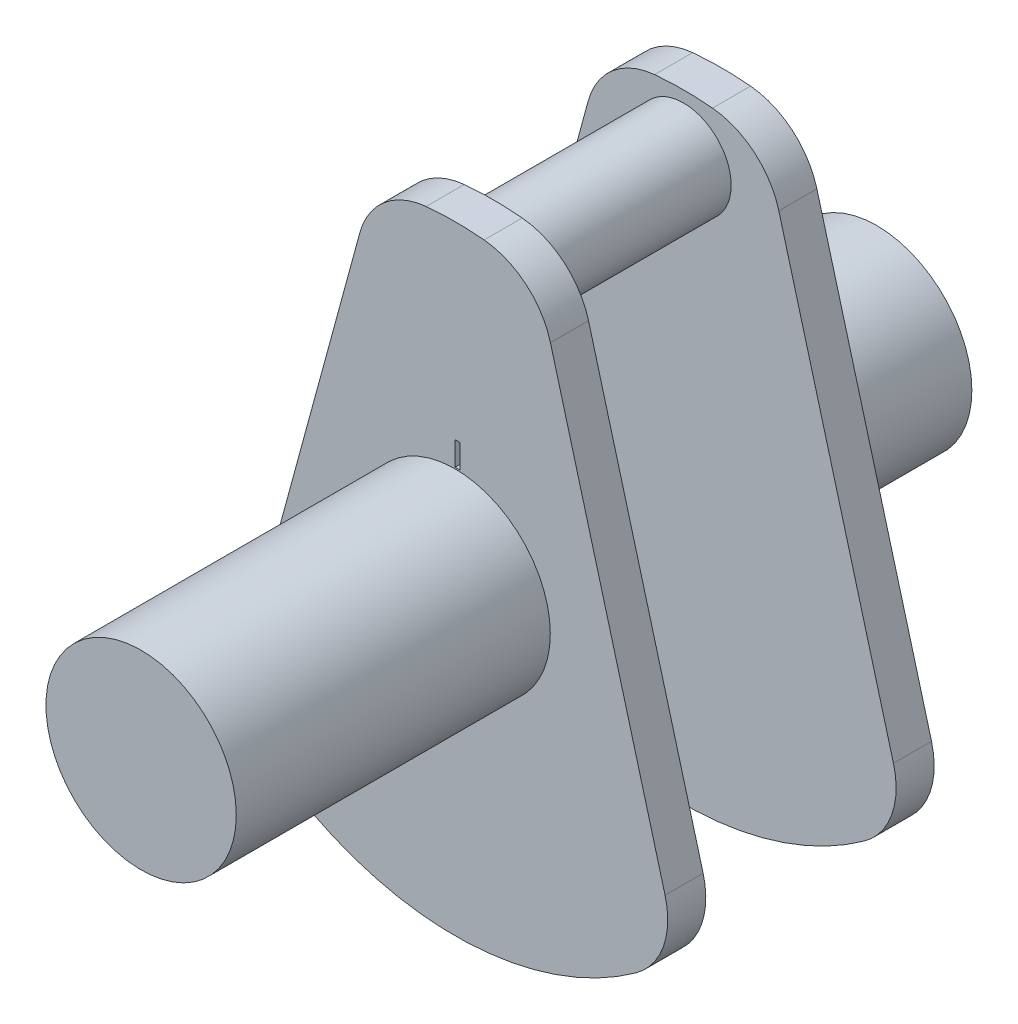
ISO-10303-21;
HEADER;
FILE_DESCRIPTION(('STEP AP214'),'2;1');
FILE_NAME('part.step','',(''),(''),'','','');
FILE_SCHEMA(('AUTOMOTIVE_DESIGN { 1 0 10303 214 1 1 1 1 }'));
ENDSEC;
DATA;
#1=APPLICATION_CONTEXT('core data for automotive mechanical design processes');
#2=APPLICATION_PROTOCOL_DEFINITION('international standard','automotive_design',2000,#1);
#3=PRODUCT_CONTEXT('',#1,'mechanical');
#4=PRODUCT('Part','Part','',(#3));
#5=PRODUCT_RELATED_PRODUCT_CATEGORY('part','',(#4));
#6=PRODUCT_DEFINITION_FORMATION('','',#4);
#7=PRODUCT_DEFINITION_CONTEXT('part definition',#1,'design');
#8=PRODUCT_DEFINITION('design','',#6,#7);
#9=PRODUCT_DEFINITION_SHAPE('','',#8);
#10=(LENGTH_UNIT() NAMED_UNIT(*) SI_UNIT(.MILLI.,.METRE.));
#11=(NAMED_UNIT(*) PLANE_ANGLE_UNIT() SI_UNIT($,.RADIAN.));
#12=(NAMED_UNIT(*) SI_UNIT($,.STERADIAN.) SOLID_ANGLE_UNIT());
#13=UNCERTAINTY_MEASURE_WITH_UNIT(LENGTH_MEASURE(1.E-05),#10,'distance_accuracy_value','');
#14=(GEOMETRIC_REPRESENTATION_CONTEXT(3) GLOBAL_UNCERTAINTY_ASSIGNED_CONTEXT((#13)) GLOBAL_UNIT_ASSIGNED_CONTEXT((#10,
#11,#12)) REPRESENTATION_CONTEXT('',''));
#15=CARTESIAN_POINT('',(0.,0.,0.));
#16=DIRECTION('',(0.,0.,1.));
#17=DIRECTION('',(1.,0.,0.));
#18=AXIS2_PLACEMENT_3D('',#15,#16,#17);
#19=CARTESIAN_POINT('',(0.459,4.87845457086565,0.8));
#20=DIRECTION('',(0.,0.,-1.));
#21=DIRECTION('',(-1.,0.,0.));
#22=AXIS2_PLACEMENT_3D('',#19,#20,#21);
#23=CYLINDRICAL_SURFACE('',#22,1.6);
#24=CARTESIAN_POINT('',(0.459,4.87845457086565,0.));
#25=DIRECTION('',(0.,0.,1.));
#26=DIRECTION('',(1.,0.,0.));
#27=AXIS2_PLACEMENT_3D('',#24,#25,#26);
#28=CIRCLE('',#27,1.6);
#29=CARTESIAN_POINT('',(2.00284320160388,5.29863092534255,0.));
#30=VERTEX_POINT('',#29);
#31=CARTESIAN_POINT('',(0.608877551020407,6.47141932869934,0.));
#32=VERTEX_POINT('',#31);
#33=EDGE_CURVE('E142',#30,#32,#28,.T.);
#34=ORIENTED_EDGE('',*,*,#33,.T.);
#35=DIRECTION('',(0.,0.,-1.));
#36=VECTOR('',#35,1.);
#37=CARTESIAN_POINT('',(0.608877551020407,6.47141932869934,0.8));
#38=LINE('',#37,#36);
#39=CARTESIAN_POINT('',(0.608877551020407,6.47141932869934,0.8));
#40=VERTEX_POINT('',#39);
#41=EDGE_CURVE('E40',#40,#32,#38,.T.);
#42=ORIENTED_EDGE('',*,*,#41,.F.);
#43=CARTESIAN_POINT('',(0.459,4.87845457086565,0.8));
#44=DIRECTION('',(0.,0.,1.));
#45=DIRECTION('',(1.,0.,0.));
#46=AXIS2_PLACEMENT_3D('',#43,#44,#45);
#47=CIRCLE('',#46,1.6);
#48=CARTESIAN_POINT('',(2.00284320160388,5.29863092534255,0.8));
#49=VERTEX_POINT('',#48);
#50=EDGE_CURVE('E158',#49,#40,#47,.T.);
#51=ORIENTED_EDGE('',*,*,#50,.F.);
#52=DIRECTION('',(0.,0.,-1.));
#53=VECTOR('',#52,1.);
#54=CARTESIAN_POINT('',(2.00284320160388,5.29863092534255,0.8));
#55=LINE('',#54,#53);
#56=EDGE_CURVE('E138',#49,#30,#55,.T.);
#57=ORIENTED_EDGE('',*,*,#56,.T.);
#58=EDGE_LOOP('',(#34,#42,#51,#57));
#59=FACE_BOUND('',#58,.T.);
#60=ADVANCED_FACE('F33',(#59),#23,.T.);
#61=CARTESIAN_POINT('',(0.,0.,0.8));
#62=DIRECTION('',(0.,0.,-1.));
#63=DIRECTION('',(-1.,0.,0.));
#64=AXIS2_PLACEMENT_3D('',#61,#62,#63);
#65=CYLINDRICAL_SURFACE('',#64,6.5);
#66=CARTESIAN_POINT('',(0.,0.,0.));
#67=DIRECTION('',(0.,0.,1.));
#68=DIRECTION('',(1.,0.,0.));
#69=AXIS2_PLACEMENT_3D('',#66,#67,#68);
#70=CIRCLE('',#69,6.5);
#71=CARTESIAN_POINT('',(-0.608877551020407,6.47141932869934,0.));
#72=VERTEX_POINT('',#71);
#73=EDGE_CURVE('E145',#32,#72,#70,.T.);
#74=ORIENTED_EDGE('',*,*,#73,.T.);
#75=DIRECTION('',(0.,0.,-1.));
#76=VECTOR('',#75,1.);
#77=CARTESIAN_POINT('',(-0.608877551020407,6.47141932869934,0.8));
#78=LINE('',#77,#76);
#79=CARTESIAN_POINT('',(-0.608877551020407,6.47141932869934,0.8));
#80=VERTEX_POINT('',#79);
#81=EDGE_CURVE('E168',#80,#72,#78,.T.);
#82=ORIENTED_EDGE('',*,*,#81,.F.);
#83=CARTESIAN_POINT('',(0.,0.,0.8));
#84=DIRECTION('',(0.,0.,1.));
#85=DIRECTION('',(1.,0.,0.));
#86=AXIS2_PLACEMENT_3D('',#83,#84,#85);
#87=CIRCLE('',#86,6.5);
#88=EDGE_CURVE('E98',#40,#80,#87,.T.);
#89=ORIENTED_EDGE('',*,*,#88,.F.);
#90=ORIENTED_EDGE('',*,*,#41,.T.);
#91=EDGE_LOOP('',(#74,#82,#89,#90));
#92=FACE_BOUND('',#91,.T.);
#93=ADVANCED_FACE('F171',(#92),#65,.T.);
#94=CARTESIAN_POINT('',(-0.459,4.87845457086565,0.8));
#95=DIRECTION('',(0.,0.,-1.));
#96=DIRECTION('',(-1.,0.,0.));
#97=AXIS2_PLACEMENT_3D('',#94,#95,#96);
#98=CYLINDRICAL_SURFACE('',#97,1.6);
#99=CARTESIAN_POINT('',(-0.459,4.87845457086565,0.));
#100=DIRECTION('',(0.,0.,1.));
#101=DIRECTION('',(-1.,0.,0.));
#102=AXIS2_PLACEMENT_3D('',#99,#100,#101);
#103=CIRCLE('',#102,1.6);
#104=CARTESIAN_POINT('',(-2.00284320160388,5.29863092534255,0.));
#105=VERTEX_POINT('',#104);
#106=EDGE_CURVE('E148',#72,#105,#103,.T.);
#107=ORIENTED_EDGE('',*,*,#106,.T.);
#108=DIRECTION('',(0.,0.,-1.));
#109=VECTOR('',#108,1.);
#110=CARTESIAN_POINT('',(-2.00284320160388,5.29863092534255,0.8));
#111=LINE('',#110,#109);
#112=CARTESIAN_POINT('',(-2.00284320160388,5.29863092534255,0.8));
#113=VERTEX_POINT('',#112);
#114=EDGE_CURVE('E165',#113,#105,#111,.T.);
#115=ORIENTED_EDGE('',*,*,#114,.F.);
#116=CARTESIAN_POINT('',(-0.459,4.87845457086565,0.8));
#117=DIRECTION('',(0.,0.,1.));
#118=DIRECTION('',(-1.,0.,0.));
#119=AXIS2_PLACEMENT_3D('',#116,#117,#118);
#120=CIRCLE('',#119,1.6);
#121=EDGE_CURVE('E189',#80,#113,#120,.T.);
#122=ORIENTED_EDGE('',*,*,#121,.F.);
#123=ORIENTED_EDGE('',*,*,#81,.T.);
#124=EDGE_LOOP('',(#107,#115,#122,#123));
#125=FACE_BOUND('',#124,.T.);
#126=ADVANCED_FACE('F182',(#125),#98,.T.);
#127=CARTESIAN_POINT('',(-2.00284320160388,5.29863092534255,0.8));
#128=DIRECTION('',(0.964902001002423,-0.26261022154806,0.));
#129=DIRECTION('',(0.26261022154806,0.964902001002423,0.));
#130=AXIS2_PLACEMENT_3D('',#127,#128,#129);
#131=PLANE('',#130);
#132=DIRECTION('',(-0.26261022154806,-0.964902001002422,0.));
#133=VECTOR('',#132,1.);
#134=CARTESIAN_POINT('',(-2.00284320160388,5.29863092534255,0.));
#135=LINE('',#134,#133);
#136=CARTESIAN_POINT('',(-4.41186786120333,-3.55278658921254,0.));
#137=VERTEX_POINT('',#136);
#138=EDGE_CURVE('E150',#105,#137,#135,.T.);
#139=ORIENTED_EDGE('',*,*,#138,.T.);
#140=DIRECTION('',(0.,0.,-1.));
#141=VECTOR('',#140,1.);
#142=CARTESIAN_POINT('',(-4.41186786120333,-3.55278658921254,0.8));
#143=LINE('',#142,#141);
#144=CARTESIAN_POINT('',(-4.41186786120333,-3.55278658921254,0.8));
#145=VERTEX_POINT('',#144);
#146=EDGE_CURVE('E162',#145,#137,#143,.T.);
#147=ORIENTED_EDGE('',*,*,#146,.F.);
#148=DIRECTION('',(-0.26261022154806,-0.964902001002422,0.));
#149=VECTOR('',#148,1.);
#150=CARTESIAN_POINT('',(-2.00284320160388,5.29863092534255,0.8));
#151=LINE('',#150,#149);
#152=EDGE_CURVE('E188',#113,#145,#151,.T.);
#153=ORIENTED_EDGE('',*,*,#152,.F.);
#154=ORIENTED_EDGE('',*,*,#114,.T.);
#155=EDGE_LOOP('',(#139,#147,#153,#154));
#156=FACE_BOUND('',#155,.T.);
#157=ADVANCED_FACE('F186',(#156),#131,.F.);
#158=CARTESIAN_POINT('',(-2.86802465959945,-3.97296294368944,0.8));
#159=DIRECTION('',(0.,0.,-1.));
#160=DIRECTION('',(-1.,0.,0.));
#161=AXIS2_PLACEMENT_3D('',#158,#159,#160);
#162=CYLINDRICAL_SURFACE('',#161,1.6);
#163=CARTESIAN_POINT('',(-2.86802465959945,-3.97296294368944,0.));
#164=DIRECTION('',(0.,0.,1.));
#165=DIRECTION('',(1.,0.,0.));
#166=AXIS2_PLACEMENT_3D('',#163,#164,#165);
#167=CIRCLE('',#166,1.6);
#168=CARTESIAN_POINT('',(-3.80452250763192,-5.27025696611864,0.));
#169=VERTEX_POINT('',#168);
#170=EDGE_CURVE('E152',#137,#169,#167,.T.);
#171=ORIENTED_EDGE('',*,*,#170,.T.);
#172=DIRECTION('',(0.,0.,-1.));
#173=VECTOR('',#172,1.);
#174=CARTESIAN_POINT('',(-3.80452250763192,-5.27025696611864,0.8));
#175=LINE('',#174,#173);
#176=CARTESIAN_POINT('',(-3.80452250763192,-5.27025696611864,0.8));
#177=VERTEX_POINT('',#176);
#178=EDGE_CURVE('E133',#177,#169,#175,.T.);
#179=ORIENTED_EDGE('',*,*,#178,.F.);
#180=CARTESIAN_POINT('',(-2.86802465959945,-3.97296294368944,0.8));
#181=DIRECTION('',(0.,0.,1.));
#182=DIRECTION('',(1.,0.,0.));
#183=AXIS2_PLACEMENT_3D('',#180,#181,#182);
#184=CIRCLE('',#183,1.6);
#185=EDGE_CURVE('E121',#145,#177,#184,.T.);
#186=ORIENTED_EDGE('',*,*,#185,.F.);
#187=ORIENTED_EDGE('',*,*,#146,.T.);
#188=EDGE_LOOP('',(#171,#179,#186,#187));
#189=FACE_BOUND('',#188,.T.);
#190=ADVANCED_FACE('F431',(#189),#162,.T.);
#191=CARTESIAN_POINT('',(0.,0.,0.8));
#192=DIRECTION('',(0.,0.,-1.));
#193=DIRECTION('',(-1.,0.,0.));
#194=AXIS2_PLACEMENT_3D('',#191,#192,#193);
#195=CYLINDRICAL_SURFACE('',#194,6.5);
#196=CARTESIAN_POINT('',(0.,0.,0.));
#197=DIRECTION('',(0.,0.,1.));
#198=DIRECTION('',(1.,0.,0.));
#199=AXIS2_PLACEMENT_3D('',#196,#197,#198);
#200=CIRCLE('',#199,6.5);
#201=CARTESIAN_POINT('',(3.80452250763193,-5.27025696611864,0.));
#202=VERTEX_POINT('',#201);
#203=EDGE_CURVE('E130',#169,#202,#200,.T.);
#204=ORIENTED_EDGE('',*,*,#203,.T.);
#205=DIRECTION('',(0.,0.,-1.));
#206=VECTOR('',#205,1.);
#207=CARTESIAN_POINT('',(3.80452250763193,-5.27025696611864,0.8));
#208=LINE('',#207,#206);
#209=CARTESIAN_POINT('',(3.80452250763193,-5.27025696611864,0.8));
#210=VERTEX_POINT('',#209);
#211=EDGE_CURVE('E127',#210,#202,#208,.T.);
#212=ORIENTED_EDGE('',*,*,#211,.F.);
#213=CARTESIAN_POINT('',(0.,0.,0.8));
#214=DIRECTION('',(0.,0.,1.));
#215=DIRECTION('',(1.,0.,0.));
#216=AXIS2_PLACEMENT_3D('',#213,#214,#215);
#217=CIRCLE('',#216,6.5);
#218=EDGE_CURVE('E114',#177,#210,#217,.T.);
#219=ORIENTED_EDGE('',*,*,#218,.F.);
#220=ORIENTED_EDGE('',*,*,#178,.T.);
#221=EDGE_LOOP('',(#204,#212,#219,#220));
#222=FACE_BOUND('',#221,.T.);
#223=ADVANCED_FACE('F128',(#222),#195,.T.);
#224=CARTESIAN_POINT('',(2.86802465959945,-3.97296294368944,0.8));
#225=DIRECTION('',(0.,0.,-1.));
#226=DIRECTION('',(-1.,0.,0.));
#227=AXIS2_PLACEMENT_3D('',#224,#225,#226);
#228=CYLINDRICAL_SURFACE('',#227,1.6);
#229=CARTESIAN_POINT('',(2.86802465959945,-3.97296294368944,0.));
#230=DIRECTION('',(0.,0.,1.));
#231=DIRECTION('',(-1.,0.,0.));
#232=AXIS2_PLACEMENT_3D('',#229,#230,#231);
#233=CIRCLE('',#232,1.6);
#234=CARTESIAN_POINT('',(4.41186786120333,-3.55278658921254,0.));
#235=VERTEX_POINT('',#234);
#236=EDGE_CURVE('E155',#202,#235,#233,.T.);
#237=ORIENTED_EDGE('',*,*,#236,.T.);
#238=DIRECTION('',(0.,0.,-1.));
#239=VECTOR('',#238,1.);
#240=CARTESIAN_POINT('',(4.41186786120333,-3.55278658921254,0.8));
#241=LINE('',#240,#239);
#242=CARTESIAN_POINT('',(4.41186786120333,-3.55278658921254,0.8));
#243=VERTEX_POINT('',#242);
#244=EDGE_CURVE('E134',#243,#235,#241,.T.);
#245=ORIENTED_EDGE('',*,*,#244,.F.);
#246=CARTESIAN_POINT('',(2.86802465959945,-3.97296294368944,0.8));
#247=DIRECTION('',(0.,0.,1.));
#248=DIRECTION('',(-1.,0.,0.));
#249=AXIS2_PLACEMENT_3D('',#246,#247,#248);
#250=CIRCLE('',#249,1.6);
#251=EDGE_CURVE('E118',#210,#243,#250,.T.);
#252=ORIENTED_EDGE('',*,*,#251,.F.);
#253=ORIENTED_EDGE('',*,*,#211,.T.);
#254=EDGE_LOOP('',(#237,#245,#252,#253));
#255=FACE_BOUND('',#254,.T.);
#256=ADVANCED_FACE('F136',(#255),#228,.T.);
#257=CARTESIAN_POINT('',(2.00284320160388,5.29863092534255,0.8));
#258=DIRECTION('',(-0.964902001002423,-0.26261022154806,0.));
#259=DIRECTION('',(0.26261022154806,-0.964902001002423,0.));
#260=AXIS2_PLACEMENT_3D('',#257,#258,#259);
#261=PLANE('',#260);
#262=DIRECTION('',(-0.26261022154806,0.964902001002422,0.));
#263=VECTOR('',#262,1.);
#264=CARTESIAN_POINT('',(2.00284320160388,5.29863092534255,0.));
#265=LINE('',#264,#263);
#266=EDGE_CURVE('E89',#235,#30,#265,.T.);
#267=ORIENTED_EDGE('',*,*,#266,.T.);
#268=ORIENTED_EDGE('',*,*,#56,.F.);
#269=DIRECTION('',(-0.26261022154806,0.964902001002422,0.));
#270=VECTOR('',#269,1.);
#271=CARTESIAN_POINT('',(2.00284320160388,5.29863092534255,0.8));
#272=LINE('',#271,#270);
#273=EDGE_CURVE('E56',#243,#49,#272,.T.);
#274=ORIENTED_EDGE('',*,*,#273,.F.);
#275=ORIENTED_EDGE('',*,*,#244,.T.);
#276=EDGE_LOOP('',(#267,#268,#274,#275));
#277=FACE_BOUND('',#276,.T.);
#278=ADVANCED_FACE('F439',(#277),#261,.F.);
#279=CARTESIAN_POINT('',(0.459,4.87845457086565,0.8));
#280=DIRECTION('',(0.,0.,1.));
#281=DIRECTION('',(1.,0.,0.));
#282=AXIS2_PLACEMENT_3D('',#279,#280,#281);
#283=PLANE('',#282);
#284=CARTESIAN_POINT('',(0.,5.26,0.8));
#285=DIRECTION('',(0.,0.,1.));
#286=DIRECTION('',(1.,0.,0.));
#287=AXIS2_PLACEMENT_3D('',#284,#285,#286);
#288=CIRCLE('',#287,1.);
#289=CARTESIAN_POINT('',(1.,5.26,0.8));
#290=VERTEX_POINT('',#289);
#291=EDGE_CURVE('E146',#290,#290,#288,.T.);
#292=ORIENTED_EDGE('',*,*,#291,.F.);
#293=EDGE_LOOP('',(#292));
#294=FACE_BOUND('',#293,.T.);
#295=ORIENTED_EDGE('',*,*,#50,.T.);
#296=ORIENTED_EDGE('',*,*,#88,.T.);
#297=ORIENTED_EDGE('',*,*,#121,.T.);
#298=ORIENTED_EDGE('',*,*,#152,.T.);
#299=ORIENTED_EDGE('',*,*,#185,.T.);
#300=ORIENTED_EDGE('',*,*,#218,.T.);
#301=ORIENTED_EDGE('',*,*,#251,.T.);
#302=ORIENTED_EDGE('',*,*,#273,.T.);
#303=EDGE_LOOP('',(#295,#296,#297,#298,#299,#300,#301,#302));
#304=FACE_BOUND('',#303,.T.);
#305=ADVANCED_FACE('F116',(#294,#304),#283,.T.);
#306=CARTESIAN_POINT('',(0.459,4.87845457086565,0.));
#307=DIRECTION('',(0.,0.,1.));
#308=DIRECTION('',(1.,0.,0.));
#309=AXIS2_PLACEMENT_3D('',#306,#307,#308);
#310=PLANE('',#309);
#311=CARTESIAN_POINT('',(0.,0.,0.));
#312=DIRECTION('',(0.,0.,1.));
#313=DIRECTION('',(1.,0.,0.));
#314=AXIS2_PLACEMENT_3D('',#311,#312,#313);
#315=CIRCLE('',#314,2.);
#316=CARTESIAN_POINT('',(2.,0.,0.));
#317=VERTEX_POINT('',#316);
#318=EDGE_CURVE('E11',#317,#317,#315,.F.);
#319=ORIENTED_EDGE('',*,*,#318,.F.);
#320=EDGE_LOOP('',(#319));
#321=FACE_BOUND('',#320,.T.);
#322=ORIENTED_EDGE('',*,*,#33,.F.);
#323=ORIENTED_EDGE('',*,*,#266,.F.);
#324=ORIENTED_EDGE('',*,*,#236,.F.);
#325=ORIENTED_EDGE('',*,*,#203,.F.);
#326=ORIENTED_EDGE('',*,*,#170,.F.);
#327=ORIENTED_EDGE('',*,*,#138,.F.);
#328=ORIENTED_EDGE('',*,*,#106,.F.);
#329=ORIENTED_EDGE('',*,*,#73,.F.);
#330=EDGE_LOOP('',(#322,#323,#324,#325,#326,#327,#328,#329));
#331=FACE_BOUND('',#330,.T.);
#332=ADVANCED_FACE('F176',(#321,#331),#310,.F.);
#333=CARTESIAN_POINT('',(0.,5.26,2.8));
#334=DIRECTION('',(0.,0.,-1.));
#335=DIRECTION('',(-1.,0.,0.));
#336=AXIS2_PLACEMENT_3D('',#333,#334,#335);
#337=CYLINDRICAL_SURFACE('',#336,1.);
#338=ORIENTED_EDGE('',*,*,#291,.T.);
#339=EDGE_LOOP('',(#338));
#340=FACE_BOUND('',#339,.T.);
#341=CARTESIAN_POINT('',(0.,5.26,4.8));
#342=DIRECTION('',(0.,0.,1.));
#343=DIRECTION('',(1.,0.,0.));
#344=AXIS2_PLACEMENT_3D('',#341,#342,#343);
#345=CIRCLE('',#344,1.);
#346=CARTESIAN_POINT('',(1.,5.26,4.8));
#347=VERTEX_POINT('',#346);
#348=EDGE_CURVE('E253',#347,#347,#345,.T.);
#349=ORIENTED_EDGE('',*,*,#348,.F.);
#350=EDGE_LOOP('',(#349));
#351=FACE_BOUND('',#350,.T.);
#352=ADVANCED_FACE('F444',(#340,#351),#337,.T.);
#353=CARTESIAN_POINT('',(0.,0.,-3.26));
#354=DIRECTION('',(0.,0.,1.));
#355=DIRECTION('',(1.,0.,0.));
#356=AXIS2_PLACEMENT_3D('',#353,#354,#355);
#357=CYLINDRICAL_SURFACE('',#356,2.);
#358=CARTESIAN_POINT('',(0.,0.,-3.26));
#359=DIRECTION('',(0.,0.,-1.));
#360=DIRECTION('',(-1.,0.,0.));
#361=AXIS2_PLACEMENT_3D('',#358,#359,#360);
#362=CIRCLE('',#361,2.);
#363=CARTESIAN_POINT('',(-2.,0.,-3.26));
#364=VERTEX_POINT('',#363);
#365=EDGE_CURVE('E197',#364,#364,#362,.T.);
#366=ORIENTED_EDGE('',*,*,#365,.F.);
#367=EDGE_LOOP('',(#366));
#368=FACE_BOUND('',#367,.T.);
#369=ORIENTED_EDGE('',*,*,#318,.T.);
#370=EDGE_LOOP('',(#369));
#371=FACE_BOUND('',#370,.T.);
#372=ADVANCED_FACE('F451',(#368,#371),#357,.T.);
#373=CARTESIAN_POINT('',(0.,0.,-3.26));
#374=DIRECTION('',(0.,0.,-1.));
#375=DIRECTION('',(-1.,0.,0.));
#376=AXIS2_PLACEMENT_3D('',#373,#374,#375);
#377=PLANE('',#376);
#378=ORIENTED_EDGE('',*,*,#365,.T.);
#379=EDGE_LOOP('',(#378));
#380=FACE_BOUND('',#379,.T.);
#381=ADVANCED_FACE('F455',(#380),#377,.T.);
#382=CARTESIAN_POINT('',(0.459,4.87845457086565,4.8));
#383=DIRECTION('',(0.,0.,1.));
#384=DIRECTION('',(-1.,0.,0.));
#385=AXIS2_PLACEMENT_3D('',#382,#383,#384);
#386=CYLINDRICAL_SURFACE('',#385,1.6);
#387=CARTESIAN_POINT('',(0.459,4.87845457086565,5.6));
#388=DIRECTION('',(0.,0.,1.));
#389=DIRECTION('',(1.,0.,0.));
#390=AXIS2_PLACEMENT_3D('',#387,#388,#389);
#391=CIRCLE('',#390,1.6);
#392=CARTESIAN_POINT('',(2.00284320160388,5.29863092534255,5.6));
#393=VERTEX_POINT('',#392);
#394=CARTESIAN_POINT('',(0.608877551020407,6.47141932869934,5.6));
#395=VERTEX_POINT('',#394);
#396=EDGE_CURVE('E250',#393,#395,#391,.T.);
#397=ORIENTED_EDGE('',*,*,#396,.F.);
#398=DIRECTION('',(0.,0.,1.));
#399=VECTOR('',#398,1.);
#400=CARTESIAN_POINT('',(2.00284320160388,5.29863092534255,4.8));
#401=LINE('',#400,#399);
#402=CARTESIAN_POINT('',(2.00284320160388,5.29863092534255,4.8));
#403=VERTEX_POINT('',#402);
#404=EDGE_CURVE('E224',#403,#393,#401,.T.);
#405=ORIENTED_EDGE('',*,*,#404,.F.);
#406=CARTESIAN_POINT('',(0.459,4.87845457086565,4.8));
#407=DIRECTION('',(0.,0.,1.));
#408=DIRECTION('',(1.,0.,0.));
#409=AXIS2_PLACEMENT_3D('',#406,#407,#408);
#410=CIRCLE('',#409,1.6);
#411=CARTESIAN_POINT('',(0.608877551020407,6.47141932869934,4.8));
#412=VERTEX_POINT('',#411);
#413=EDGE_CURVE('E231',#403,#412,#410,.T.);
#414=ORIENTED_EDGE('',*,*,#413,.T.);
#415=DIRECTION('',(0.,0.,1.));
#416=VECTOR('',#415,1.);
#417=CARTESIAN_POINT('',(0.608877551020407,6.47141932869934,4.8));
#418=LINE('',#417,#416);
#419=EDGE_CURVE('E203',#412,#395,#418,.T.);
#420=ORIENTED_EDGE('',*,*,#419,.T.);
#421=EDGE_LOOP('',(#397,#405,#414,#420));
#422=FACE_BOUND('',#421,.T.);
#423=ADVANCED_FACE('F386',(#422),#386,.T.);
#424=CARTESIAN_POINT('',(0.,0.,4.8));
#425=DIRECTION('',(0.,0.,1.));
#426=DIRECTION('',(-1.,0.,0.));
#427=AXIS2_PLACEMENT_3D('',#424,#425,#426);
#428=CYLINDRICAL_SURFACE('',#427,6.5);
#429=CARTESIAN_POINT('',(0.,0.,5.6));
#430=DIRECTION('',(0.,0.,1.));
#431=DIRECTION('',(1.,0.,0.));
#432=AXIS2_PLACEMENT_3D('',#429,#430,#431);
#433=CIRCLE('',#432,6.5);
#434=CARTESIAN_POINT('',(-0.608877551020407,6.47141932869934,5.6));
#435=VERTEX_POINT('',#434);
#436=EDGE_CURVE('E247',#395,#435,#433,.T.);
#437=ORIENTED_EDGE('',*,*,#436,.F.);
#438=ORIENTED_EDGE('',*,*,#419,.F.);
#439=CARTESIAN_POINT('',(0.,0.,4.8));
#440=DIRECTION('',(0.,0.,1.));
#441=DIRECTION('',(1.,0.,0.));
#442=AXIS2_PLACEMENT_3D('',#439,#440,#441);
#443=CIRCLE('',#442,6.5);
#444=CARTESIAN_POINT('',(-0.608877551020407,6.47141932869934,4.8));
#445=VERTEX_POINT('',#444);
#446=EDGE_CURVE('E271',#412,#445,#443,.T.);
#447=ORIENTED_EDGE('',*,*,#446,.T.);
#448=DIRECTION('',(0.,0.,1.));
#449=VECTOR('',#448,1.);
#450=CARTESIAN_POINT('',(-0.608877551020407,6.47141932869934,4.8));
#451=LINE('',#450,#449);
#452=EDGE_CURVE('E206',#445,#435,#451,.T.);
#453=ORIENTED_EDGE('',*,*,#452,.T.);
#454=EDGE_LOOP('',(#437,#438,#447,#453));
#455=FACE_BOUND('',#454,.T.);
#456=ADVANCED_FACE('F389',(#455),#428,.T.);
#457=CARTESIAN_POINT('',(-0.459,4.87845457086565,4.8));
#458=DIRECTION('',(0.,0.,1.));
#459=DIRECTION('',(-1.,0.,0.));
#460=AXIS2_PLACEMENT_3D('',#457,#458,#459);
#461=CYLINDRICAL_SURFACE('',#460,1.6);
#462=CARTESIAN_POINT('',(-0.459,4.87845457086565,5.6));
#463=DIRECTION('',(0.,0.,1.));
#464=DIRECTION('',(-1.,0.,0.));
#465=AXIS2_PLACEMENT_3D('',#462,#463,#464);
#466=CIRCLE('',#465,1.6);
#467=CARTESIAN_POINT('',(-2.00284320160388,5.29863092534255,5.6));
#468=VERTEX_POINT('',#467);
#469=EDGE_CURVE('E244',#435,#468,#466,.T.);
#470=ORIENTED_EDGE('',*,*,#469,.F.);
#471=ORIENTED_EDGE('',*,*,#452,.F.);
#472=CARTESIAN_POINT('',(-0.459,4.87845457086565,4.8));
#473=DIRECTION('',(0.,0.,1.));
#474=DIRECTION('',(-1.,0.,0.));
#475=AXIS2_PLACEMENT_3D('',#472,#473,#474);
#476=CIRCLE('',#475,1.6);
#477=CARTESIAN_POINT('',(-2.00284320160388,5.29863092534255,4.8));
#478=VERTEX_POINT('',#477);
#479=EDGE_CURVE('E268',#445,#478,#476,.T.);
#480=ORIENTED_EDGE('',*,*,#479,.T.);
#481=DIRECTION('',(0.,0.,1.));
#482=VECTOR('',#481,1.);
#483=CARTESIAN_POINT('',(-2.00284320160388,5.29863092534255,4.8));
#484=LINE('',#483,#482);
#485=EDGE_CURVE('E209',#478,#468,#484,.T.);
#486=ORIENTED_EDGE('',*,*,#485,.T.);
#487=EDGE_LOOP('',(#470,#471,#480,#486));
#488=FACE_BOUND('',#487,.T.);
#489=ADVANCED_FACE('F392',(#488),#461,.T.);
#490=CARTESIAN_POINT('',(-2.00284320160388,5.29863092534255,4.8));
#491=DIRECTION('',(0.964902001002423,-0.26261022154806,0.));
#492=DIRECTION('',(0.26261022154806,0.964902001002423,0.));
#493=AXIS2_PLACEMENT_3D('',#490,#491,#492);
#494=PLANE('',#493);
#495=DIRECTION('',(-0.26261022154806,-0.964902001002422,0.));
#496=VECTOR('',#495,1.);
#497=CARTESIAN_POINT('',(-2.00284320160388,5.29863092534255,5.6));
#498=LINE('',#497,#496);
#499=CARTESIAN_POINT('',(-4.41186786120333,-3.55278658921254,5.6));
#500=VERTEX_POINT('',#499);
#501=EDGE_CURVE('E241',#468,#500,#498,.T.);
#502=ORIENTED_EDGE('',*,*,#501,.F.);
#503=ORIENTED_EDGE('',*,*,#485,.F.);
#504=DIRECTION('',(-0.26261022154806,-0.964902001002422,0.));
#505=VECTOR('',#504,1.);
#506=CARTESIAN_POINT('',(-2.00284320160388,5.29863092534255,4.8));
#507=LINE('',#506,#505);
#508=CARTESIAN_POINT('',(-4.41186786120333,-3.55278658921254,4.8));
#509=VERTEX_POINT('',#508);
#510=EDGE_CURVE('E265',#478,#509,#507,.T.);
#511=ORIENTED_EDGE('',*,*,#510,.T.);
#512=DIRECTION('',(0.,0.,1.));
#513=VECTOR('',#512,1.);
#514=CARTESIAN_POINT('',(-4.41186786120333,-3.55278658921254,4.8));
#515=LINE('',#514,#513);
#516=EDGE_CURVE('E212',#509,#500,#515,.T.);
#517=ORIENTED_EDGE('',*,*,#516,.T.);
#518=EDGE_LOOP('',(#502,#503,#511,#517));
#519=FACE_BOUND('',#518,.T.);
#520=ADVANCED_FACE('F395',(#519),#494,.F.);
#521=CARTESIAN_POINT('',(-2.86802465959945,-3.97296294368944,4.8));
#522=DIRECTION('',(0.,0.,1.));
#523=DIRECTION('',(-1.,0.,0.));
#524=AXIS2_PLACEMENT_3D('',#521,#522,#523);
#525=CYLINDRICAL_SURFACE('',#524,1.6);
#526=CARTESIAN_POINT('',(-2.86802465959945,-3.97296294368944,5.6));
#527=DIRECTION('',(0.,0.,1.));
#528=DIRECTION('',(1.,0.,0.));
#529=AXIS2_PLACEMENT_3D('',#526,#527,#528);
#530=CIRCLE('',#529,1.6);
#531=CARTESIAN_POINT('',(-3.80452250763192,-5.27025696611864,5.6));
#532=VERTEX_POINT('',#531);
#533=EDGE_CURVE('E238',#500,#532,#530,.T.);
#534=ORIENTED_EDGE('',*,*,#533,.F.);
#535=ORIENTED_EDGE('',*,*,#516,.F.);
#536=CARTESIAN_POINT('',(-2.86802465959945,-3.97296294368944,4.8));
#537=DIRECTION('',(0.,0.,1.));
#538=DIRECTION('',(1.,0.,0.));
#539=AXIS2_PLACEMENT_3D('',#536,#537,#538);
#540=CIRCLE('',#539,1.6);
#541=CARTESIAN_POINT('',(-3.80452250763192,-5.27025696611864,4.8));
#542=VERTEX_POINT('',#541);
#543=EDGE_CURVE('E262',#509,#542,#540,.T.);
#544=ORIENTED_EDGE('',*,*,#543,.T.);
#545=DIRECTION('',(0.,0.,1.));
#546=VECTOR('',#545,1.);
#547=CARTESIAN_POINT('',(-3.80452250763192,-5.27025696611864,4.8));
#548=LINE('',#547,#546);
#549=EDGE_CURVE('E215',#542,#532,#548,.T.);
#550=ORIENTED_EDGE('',*,*,#549,.T.);
#551=EDGE_LOOP('',(#534,#535,#544,#550));
#552=FACE_BOUND('',#551,.T.);
#553=ADVANCED_FACE('F398',(#552),#525,.T.);
#554=CARTESIAN_POINT('',(0.,0.,4.8));
#555=DIRECTION('',(0.,0.,1.));
#556=DIRECTION('',(-1.,0.,0.));
#557=AXIS2_PLACEMENT_3D('',#554,#555,#556);
#558=CYLINDRICAL_SURFACE('',#557,6.5);
#559=CARTESIAN_POINT('',(0.,0.,5.6));
#560=DIRECTION('',(0.,0.,1.));
#561=DIRECTION('',(1.,0.,0.));
#562=AXIS2_PLACEMENT_3D('',#559,#560,#561);
#563=CIRCLE('',#562,6.5);
#564=CARTESIAN_POINT('',(3.80452250763193,-5.27025696611864,5.6));
#565=VERTEX_POINT('',#564);
#566=EDGE_CURVE('E235',#532,#565,#563,.T.);
#567=ORIENTED_EDGE('',*,*,#566,.F.);
#568=ORIENTED_EDGE('',*,*,#549,.F.);
#569=CARTESIAN_POINT('',(0.,0.,4.8));
#570=DIRECTION('',(0.,0.,1.));
#571=DIRECTION('',(1.,0.,0.));
#572=AXIS2_PLACEMENT_3D('',#569,#570,#571);
#573=CIRCLE('',#572,6.5);
#574=CARTESIAN_POINT('',(3.80452250763193,-5.27025696611864,4.8));
#575=VERTEX_POINT('',#574);
#576=EDGE_CURVE('E259',#542,#575,#573,.T.);
#577=ORIENTED_EDGE('',*,*,#576,.T.);
#578=DIRECTION('',(0.,0.,1.));
#579=VECTOR('',#578,1.);
#580=CARTESIAN_POINT('',(3.80452250763193,-5.27025696611864,4.8));
#581=LINE('',#580,#579);
#582=EDGE_CURVE('E218',#575,#565,#581,.T.);
#583=ORIENTED_EDGE('',*,*,#582,.T.);
#584=EDGE_LOOP('',(#567,#568,#577,#583));
#585=FACE_BOUND('',#584,.T.);
#586=ADVANCED_FACE('F401',(#585),#558,.T.);
#587=CARTESIAN_POINT('',(2.86802465959945,-3.97296294368944,4.8));
#588=DIRECTION('',(0.,0.,1.));
#589=DIRECTION('',(-1.,0.,0.));
#590=AXIS2_PLACEMENT_3D('',#587,#588,#589);
#591=CYLINDRICAL_SURFACE('',#590,1.6);
#592=CARTESIAN_POINT('',(2.86802465959945,-3.97296294368944,5.6));
#593=DIRECTION('',(0.,0.,1.));
#594=DIRECTION('',(-1.,0.,0.));
#595=AXIS2_PLACEMENT_3D('',#592,#593,#594);
#596=CIRCLE('',#595,1.6);
#597=CARTESIAN_POINT('',(4.41186786120333,-3.55278658921254,5.6));
#598=VERTEX_POINT('',#597);
#599=EDGE_CURVE('E232',#565,#598,#596,.T.);
#600=ORIENTED_EDGE('',*,*,#599,.F.);
#601=ORIENTED_EDGE('',*,*,#582,.F.);
#602=CARTESIAN_POINT('',(2.86802465959945,-3.97296294368944,4.8));
#603=DIRECTION('',(0.,0.,1.));
#604=DIRECTION('',(-1.,0.,0.));
#605=AXIS2_PLACEMENT_3D('',#602,#603,#604);
#606=CIRCLE('',#605,1.6);
#607=CARTESIAN_POINT('',(4.41186786120333,-3.55278658921254,4.8));
#608=VERTEX_POINT('',#607);
#609=EDGE_CURVE('E256',#575,#608,#606,.T.);
#610=ORIENTED_EDGE('',*,*,#609,.T.);
#611=DIRECTION('',(0.,0.,1.));
#612=VECTOR('',#611,1.);
#613=CARTESIAN_POINT('',(4.41186786120333,-3.55278658921254,4.8));
#614=LINE('',#613,#612);
#615=EDGE_CURVE('E221',#608,#598,#614,.T.);
#616=ORIENTED_EDGE('',*,*,#615,.T.);
#617=EDGE_LOOP('',(#600,#601,#610,#616));
#618=FACE_BOUND('',#617,.T.);
#619=ADVANCED_FACE('F404',(#618),#591,.T.);
#620=CARTESIAN_POINT('',(2.00284320160388,5.29863092534255,4.8));
#621=DIRECTION('',(-0.964902001002423,-0.26261022154806,0.));
#622=DIRECTION('',(0.26261022154806,-0.964902001002423,0.));
#623=AXIS2_PLACEMENT_3D('',#620,#621,#622);
#624=PLANE('',#623);
#625=DIRECTION('',(-0.26261022154806,0.964902001002422,0.));
#626=VECTOR('',#625,1.);
#627=CARTESIAN_POINT('',(2.00284320160388,5.29863092534255,5.6));
#628=LINE('',#627,#626);
#629=EDGE_CURVE('E228',#598,#393,#628,.T.);
#630=ORIENTED_EDGE('',*,*,#629,.F.);
#631=ORIENTED_EDGE('',*,*,#615,.F.);
#632=DIRECTION('',(-0.26261022154806,0.964902001002422,0.));
#633=VECTOR('',#632,1.);
#634=CARTESIAN_POINT('',(2.00284320160388,5.29863092534255,4.8));
#635=LINE('',#634,#633);
#636=EDGE_CURVE('E227',#608,#403,#635,.T.);
#637=ORIENTED_EDGE('',*,*,#636,.T.);
#638=ORIENTED_EDGE('',*,*,#404,.T.);
#639=EDGE_LOOP('',(#630,#631,#637,#638));
#640=FACE_BOUND('',#639,.T.);
#641=ADVANCED_FACE('F383',(#640),#624,.F.);
#642=CARTESIAN_POINT('',(0.459,4.87845457086565,4.8));
#643=DIRECTION('',(0.,0.,-1.));
#644=DIRECTION('',(1.,0.,0.));
#645=AXIS2_PLACEMENT_3D('',#642,#643,#644);
#646=PLANE('',#645);
#647=ORIENTED_EDGE('',*,*,#348,.T.);
#648=EDGE_LOOP('',(#647));
#649=FACE_BOUND('',#648,.T.);
#650=ORIENTED_EDGE('',*,*,#413,.F.);
#651=ORIENTED_EDGE('',*,*,#636,.F.);
#652=ORIENTED_EDGE('',*,*,#609,.F.);
#653=ORIENTED_EDGE('',*,*,#576,.F.);
#654=ORIENTED_EDGE('',*,*,#543,.F.);
#655=ORIENTED_EDGE('',*,*,#510,.F.);
#656=ORIENTED_EDGE('',*,*,#479,.F.);
#657=ORIENTED_EDGE('',*,*,#446,.F.);
#658=EDGE_LOOP('',(#650,#651,#652,#653,#654,#655,#656,#657));
#659=FACE_BOUND('',#658,.T.);
#660=ADVANCED_FACE('F406',(#649,#659),#646,.T.);
#661=CARTESIAN_POINT('',(0.459,4.87845457086565,5.6));
#662=DIRECTION('',(0.,0.,-1.));
#663=DIRECTION('',(1.,0.,0.));
#664=AXIS2_PLACEMENT_3D('',#661,#662,#663);
#665=PLANE('',#664);
#666=DIRECTION('',(1.,0.,0.));
#667=VECTOR('',#666,1.);
#668=CARTESIAN_POINT('',(0.,2.03057328896869,5.6));
#669=LINE('',#668,#667);
#670=CARTESIAN_POINT('',(0.,2.03057328896869,5.6));
#671=VERTEX_POINT('',#670);
#672=CARTESIAN_POINT('',(0.1,2.03057328896869,5.6));
#673=VERTEX_POINT('',#672);
#674=EDGE_CURVE('E299',#671,#673,#669,.T.);
#675=ORIENTED_EDGE('',*,*,#674,.F.);
#676=DIRECTION('',(0.,-1.,0.));
#677=VECTOR('',#676,1.);
#678=CARTESIAN_POINT('',(0.,2.53057328896869,5.6));
#679=LINE('',#678,#677);
#680=CARTESIAN_POINT('',(0.,2.53057328896869,5.6));
#681=VERTEX_POINT('',#680);
#682=EDGE_CURVE('E47',#681,#671,#679,.T.);
#683=ORIENTED_EDGE('',*,*,#682,.F.);
#684=DIRECTION('',(-1.,0.,0.));
#685=VECTOR('',#684,1.);
#686=CARTESIAN_POINT('',(0.,2.53057328896869,5.6));
#687=LINE('',#686,#685);
#688=CARTESIAN_POINT('',(0.1,2.53057328896869,5.6));
#689=VERTEX_POINT('',#688);
#690=EDGE_CURVE('E292',#689,#681,#687,.T.);
#691=ORIENTED_EDGE('',*,*,#690,.F.);
#692=DIRECTION('',(0.,1.,0.));
#693=VECTOR('',#692,1.);
#694=CARTESIAN_POINT('',(0.1,2.53057328896869,5.6));
#695=LINE('',#694,#693);
#696=EDGE_CURVE('E296',#673,#689,#695,.T.);
#697=ORIENTED_EDGE('',*,*,#696,.F.);
#698=EDGE_LOOP('',(#675,#683,#691,#697));
#699=FACE_BOUND('',#698,.T.);
#700=CARTESIAN_POINT('',(0.,0.,5.6));
#701=DIRECTION('',(0.,0.,1.));
#702=DIRECTION('',(1.,0.,0.));
#703=AXIS2_PLACEMENT_3D('',#700,#701,#702);
#704=CIRCLE('',#703,2.);
#705=CARTESIAN_POINT('',(2.,0.,5.6));
#706=VERTEX_POINT('',#705);
#707=EDGE_CURVE('E200',#706,#706,#704,.F.);
#708=ORIENTED_EDGE('',*,*,#707,.T.);
#709=EDGE_LOOP('',(#708));
#710=FACE_BOUND('',#709,.T.);
#711=ORIENTED_EDGE('',*,*,#396,.T.);
#712=ORIENTED_EDGE('',*,*,#436,.T.);
#713=ORIENTED_EDGE('',*,*,#469,.T.);
#714=ORIENTED_EDGE('',*,*,#501,.T.);
#715=ORIENTED_EDGE('',*,*,#533,.T.);
#716=ORIENTED_EDGE('',*,*,#566,.T.);
#717=ORIENTED_EDGE('',*,*,#599,.T.);
#718=ORIENTED_EDGE('',*,*,#629,.T.);
#719=EDGE_LOOP('',(#711,#712,#713,#714,#715,#716,#717,#718));
#720=FACE_BOUND('',#719,.T.);
#721=ADVANCED_FACE('F380',(#699,#710,#720),#665,.F.);
#722=CARTESIAN_POINT('',(0.,0.,8.86));
#723=DIRECTION('',(0.,0.,-1.));
#724=DIRECTION('',(1.,0.,0.));
#725=AXIS2_PLACEMENT_3D('',#722,#723,#724);
#726=CYLINDRICAL_SURFACE('',#725,2.);
#727=ORIENTED_EDGE('',*,*,#707,.F.);
#728=EDGE_LOOP('',(#727));
#729=FACE_BOUND('',#728,.T.);
#730=CARTESIAN_POINT('',(0.,0.,12.2));
#731=DIRECTION('',(0.,0.,1.));
#732=DIRECTION('',(1.,0.,0.));
#733=AXIS2_PLACEMENT_3D('',#730,#731,#732);
#734=CIRCLE('',#733,2.);
#735=CARTESIAN_POINT('',(2.,0.,12.2));
#736=VERTEX_POINT('',#735);
#737=EDGE_CURVE('E278',#736,#736,#734,.T.);
#738=ORIENTED_EDGE('',*,*,#737,.F.);
#739=EDGE_LOOP('',(#738));
#740=FACE_BOUND('',#739,.T.);
#741=ADVANCED_FACE('F415',(#729,#740),#726,.T.);
#742=CARTESIAN_POINT('',(0.,0.,12.2));
#743=DIRECTION('',(0.,0.,1.));
#744=DIRECTION('',(1.,0.,0.));
#745=AXIS2_PLACEMENT_3D('',#742,#743,#744);
#746=PLANE('',#745);
#747=ORIENTED_EDGE('',*,*,#737,.T.);
#748=EDGE_LOOP('',(#747));
#749=FACE_BOUND('',#748,.T.);
#750=ADVANCED_FACE('F495',(#749),#746,.T.);
#751=CARTESIAN_POINT('',(0.,2.53057328896869,5.5));
#752=DIRECTION('',(-1.,0.,0.));
#753=DIRECTION('',(0.,0.,1.));
#754=AXIS2_PLACEMENT_3D('',#751,#752,#753);
#755=PLANE('',#754);
#756=ORIENTED_EDGE('',*,*,#682,.T.);
#757=DIRECTION('',(0.,0.,1.));
#758=VECTOR('',#757,1.);
#759=CARTESIAN_POINT('',(0.,2.03057328896869,5.5));
#760=LINE('',#759,#758);
#761=CARTESIAN_POINT('',(0.,2.03057328896869,5.5));
#762=VERTEX_POINT('',#761);
#763=EDGE_CURVE('E282',#762,#671,#760,.T.);
#764=ORIENTED_EDGE('',*,*,#763,.F.);
#765=DIRECTION('',(0.,-1.,0.));
#766=VECTOR('',#765,1.);
#767=CARTESIAN_POINT('',(0.,2.53057328896869,5.5));
#768=LINE('',#767,#766);
#769=CARTESIAN_POINT('',(0.,2.53057328896869,5.5));
#770=VERTEX_POINT('',#769);
#771=EDGE_CURVE('E295',#770,#762,#768,.T.);
#772=ORIENTED_EDGE('',*,*,#771,.F.);
#773=DIRECTION('',(0.,0.,1.));
#774=VECTOR('',#773,1.);
#775=CARTESIAN_POINT('',(0.,2.53057328896869,5.5));
#776=LINE('',#775,#774);
#777=EDGE_CURVE('E281',#770,#681,#776,.T.);
#778=ORIENTED_EDGE('',*,*,#777,.T.);
#779=EDGE_LOOP('',(#756,#764,#772,#778));
#780=FACE_BOUND('',#779,.T.);
#781=ADVANCED_FACE('F322',(#780),#755,.F.);
#782=CARTESIAN_POINT('',(0.,2.53057328896869,5.5));
#783=DIRECTION('',(0.,1.,0.));
#784=DIRECTION('',(0.,0.,1.));
#785=AXIS2_PLACEMENT_3D('',#782,#783,#784);
#786=PLANE('',#785);
#787=ORIENTED_EDGE('',*,*,#690,.T.);
#788=ORIENTED_EDGE('',*,*,#777,.F.);
#789=DIRECTION('',(-1.,0.,0.));
#790=VECTOR('',#789,1.);
#791=CARTESIAN_POINT('',(0.,2.53057328896869,5.5));
#792=LINE('',#791,#790);
#793=CARTESIAN_POINT('',(0.1,2.53057328896869,5.5));
#794=VERTEX_POINT('',#793);
#795=EDGE_CURVE('E285',#794,#770,#792,.T.);
#796=ORIENTED_EDGE('',*,*,#795,.F.);
#797=DIRECTION('',(0.,0.,1.));
#798=VECTOR('',#797,1.);
#799=CARTESIAN_POINT('',(0.1,2.53057328896869,5.5));
#800=LINE('',#799,#798);
#801=EDGE_CURVE('E288',#794,#689,#800,.T.);
#802=ORIENTED_EDGE('',*,*,#801,.T.);
#803=EDGE_LOOP('',(#787,#788,#796,#802));
#804=FACE_BOUND('',#803,.T.);
#805=ADVANCED_FACE('F516',(#804),#786,.F.);
#806=CARTESIAN_POINT('',(0.1,2.53057328896869,5.5));
#807=DIRECTION('',(1.,0.,0.));
#808=DIRECTION('',(0.,0.,-1.));
#809=AXIS2_PLACEMENT_3D('',#806,#807,#808);
#810=PLANE('',#809);
#811=ORIENTED_EDGE('',*,*,#696,.T.);
#812=ORIENTED_EDGE('',*,*,#801,.F.);
#813=DIRECTION('',(0.,1.,0.));
#814=VECTOR('',#813,1.);
#815=CARTESIAN_POINT('',(0.1,2.53057328896869,5.5));
#816=LINE('',#815,#814);
#817=CARTESIAN_POINT('',(0.1,2.03057328896869,5.5));
#818=VERTEX_POINT('',#817);
#819=EDGE_CURVE('E305',#818,#794,#816,.T.);
#820=ORIENTED_EDGE('',*,*,#819,.F.);
#821=DIRECTION('',(0.,0.,1.));
#822=VECTOR('',#821,1.);
#823=CARTESIAN_POINT('',(0.1,2.03057328896869,5.5));
#824=LINE('',#823,#822);
#825=EDGE_CURVE('E284',#818,#673,#824,.T.);
#826=ORIENTED_EDGE('',*,*,#825,.T.);
#827=EDGE_LOOP('',(#811,#812,#820,#826));
#828=FACE_BOUND('',#827,.T.);
#829=ADVANCED_FACE('F525',(#828),#810,.F.);
#830=CARTESIAN_POINT('',(0.,2.03057328896869,5.5));
#831=DIRECTION('',(0.,-1.,0.));
#832=DIRECTION('',(0.,0.,-1.));
#833=AXIS2_PLACEMENT_3D('',#830,#831,#832);
#834=PLANE('',#833);
#835=ORIENTED_EDGE('',*,*,#674,.T.);
#836=ORIENTED_EDGE('',*,*,#825,.F.);
#837=DIRECTION('',(1.,0.,0.));
#838=VECTOR('',#837,1.);
#839=CARTESIAN_POINT('',(0.,2.03057328896869,5.5));
#840=LINE('',#839,#838);
#841=EDGE_CURVE('E308',#762,#818,#840,.T.);
#842=ORIENTED_EDGE('',*,*,#841,.F.);
#843=ORIENTED_EDGE('',*,*,#763,.T.);
#844=EDGE_LOOP('',(#835,#836,#842,#843));
#845=FACE_BOUND('',#844,.T.);
#846=ADVANCED_FACE('F534',(#845),#834,.F.);
#847=CARTESIAN_POINT('',(0.,0.,5.5));
#848=DIRECTION('',(0.,0.,1.));
#849=DIRECTION('',(1.,0.,0.));
#850=AXIS2_PLACEMENT_3D('',#847,#848,#849);
#851=PLANE('',#850);
#852=ORIENTED_EDGE('',*,*,#771,.T.);
#853=ORIENTED_EDGE('',*,*,#841,.T.);
#854=ORIENTED_EDGE('',*,*,#819,.T.);
#855=ORIENTED_EDGE('',*,*,#795,.T.);
#856=EDGE_LOOP('',(#852,#853,#854,#855));
#857=FACE_BOUND('',#856,.T.);
#858=ADVANCED_FACE('F315',(#857),#851,.T.);
#859=CLOSED_SHELL('',(#60,#93,#126,#157,#190,#223,#256,#278,#305,#332,#352,#372,#381,#423,#456,
#489,#520,#553,#586,#619,#641,#660,#721,#741,#750,#781,#805,#829,#846,#858));
#860=MANIFOLD_SOLID_BREP('B2',#859);
#861=ADVANCED_BREP_SHAPE_REPRESENTATION('',(#18,#860),#14);
#862=SHAPE_DEFINITION_REPRESENTATION(#9,#861);
ENDSEC;
END-ISO-10303-21;
